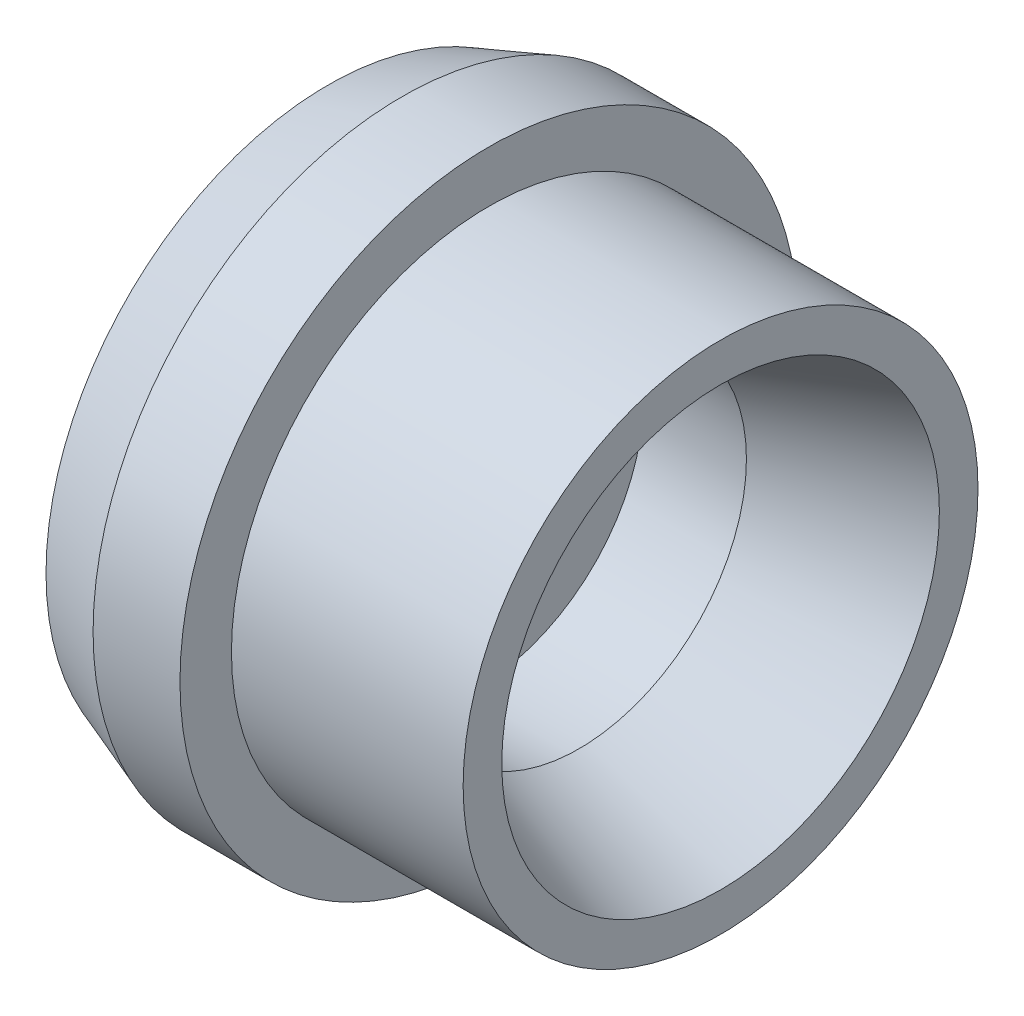
ISO-10303-21;
HEADER;
FILE_DESCRIPTION(('STEP AP214'),'2;1');
FILE_NAME('part.step','',(''),(''),'','','');
FILE_SCHEMA(('AUTOMOTIVE_DESIGN { 1 0 10303 214 1 1 1 1 }'));
ENDSEC;
DATA;
#1=APPLICATION_CONTEXT('core data for automotive mechanical design processes');
#2=APPLICATION_PROTOCOL_DEFINITION('international standard','automotive_design',2000,#1);
#3=PRODUCT_CONTEXT('',#1,'mechanical');
#4=PRODUCT('Part','Part','',(#3));
#5=PRODUCT_RELATED_PRODUCT_CATEGORY('part','',(#4));
#6=PRODUCT_DEFINITION_FORMATION('','',#4);
#7=PRODUCT_DEFINITION_CONTEXT('part definition',#1,'design');
#8=PRODUCT_DEFINITION('design','',#6,#7);
#9=PRODUCT_DEFINITION_SHAPE('','',#8);
#10=(LENGTH_UNIT() NAMED_UNIT(*) SI_UNIT(.MILLI.,.METRE.));
#11=(NAMED_UNIT(*) PLANE_ANGLE_UNIT() SI_UNIT($,.RADIAN.));
#12=(NAMED_UNIT(*) SI_UNIT($,.STERADIAN.) SOLID_ANGLE_UNIT());
#13=UNCERTAINTY_MEASURE_WITH_UNIT(LENGTH_MEASURE(1.E-05),#10,'distance_accuracy_value','');
#14=(GEOMETRIC_REPRESENTATION_CONTEXT(3) GLOBAL_UNCERTAINTY_ASSIGNED_CONTEXT((#13)) GLOBAL_UNIT_ASSIGNED_CONTEXT((#10,
#11,#12)) REPRESENTATION_CONTEXT('',''));
#15=CARTESIAN_POINT('',(0.,0.,0.));
#16=DIRECTION('',(0.,0.,1.));
#17=DIRECTION('',(1.,0.,0.));
#18=AXIS2_PLACEMENT_3D('',#15,#16,#17);
#19=CARTESIAN_POINT('',(0.,0.,0.));
#20=DIRECTION('',(-1.,0.,0.));
#21=DIRECTION('',(0.,0.,-1.));
#22=AXIS2_PLACEMENT_3D('',#19,#20,#21);
#23=PLANE('',#22);
#24=CARTESIAN_POINT('',(0.,0.,0.));
#25=DIRECTION('',(-1.,0.,0.));
#26=DIRECTION('',(0.,0.,1.));
#27=AXIS2_PLACEMENT_3D('',#24,#25,#26);
#28=CIRCLE('',#27,5.56442147285421);
#29=CARTESIAN_POINT('',(0.,0.,5.56442147285421));
#30=VERTEX_POINT('',#29);
#31=EDGE_CURVE('E10',#30,#30,#28,.T.);
#32=ORIENTED_EDGE('',*,*,#31,.T.);
#33=EDGE_LOOP('',(#32));
#34=FACE_BOUND('',#33,.T.);
#35=ADVANCED_FACE('F39',(#34),#23,.T.);
#36=CARTESIAN_POINT('',(1.4605,0.,0.));
#37=DIRECTION('',(1.,0.,0.));
#38=DIRECTION('',(0.,0.,1.));
#39=AXIS2_PLACEMENT_3D('',#36,#37,#38);
#40=CONICAL_SURFACE('',#39,6.096,0.349065850398867);
#41=ORIENTED_EDGE('',*,*,#31,.F.);
#42=EDGE_LOOP('',(#41));
#43=FACE_BOUND('',#42,.T.);
#44=CARTESIAN_POINT('',(1.4605,0.,0.));
#45=DIRECTION('',(-1.,0.,0.));
#46=DIRECTION('',(0.,0.,1.));
#47=AXIS2_PLACEMENT_3D('',#44,#45,#46);
#48=CIRCLE('',#47,6.096);
#49=CARTESIAN_POINT('',(1.4605,0.,6.096));
#50=VERTEX_POINT('',#49);
#51=EDGE_CURVE('E45',#50,#50,#48,.T.);
#52=ORIENTED_EDGE('',*,*,#51,.T.);
#53=EDGE_LOOP('',(#52));
#54=FACE_BOUND('',#53,.T.);
#55=ADVANCED_FACE('F83',(#43,#54),#40,.T.);
#56=CARTESIAN_POINT('',(2.921,0.,0.));
#57=DIRECTION('',(1.,0.,0.));
#58=DIRECTION('',(0.,0.,1.));
#59=AXIS2_PLACEMENT_3D('',#56,#57,#58);
#60=CYLINDRICAL_SURFACE('',#59,6.096);
#61=ORIENTED_EDGE('',*,*,#51,.F.);
#62=EDGE_LOOP('',(#61));
#63=FACE_BOUND('',#62,.T.);
#64=CARTESIAN_POINT('',(3.175,0.,0.));
#65=DIRECTION('',(-1.,0.,0.));
#66=DIRECTION('',(0.,0.,1.));
#67=AXIS2_PLACEMENT_3D('',#64,#65,#66);
#68=CIRCLE('',#67,6.096);
#69=CARTESIAN_POINT('',(3.175,0.,6.096));
#70=VERTEX_POINT('',#69);
#71=EDGE_CURVE('E49',#70,#70,#68,.T.);
#72=ORIENTED_EDGE('',*,*,#71,.T.);
#73=EDGE_LOOP('',(#72));
#74=FACE_BOUND('',#73,.T.);
#75=ADVANCED_FACE('F87',(#63,#74),#60,.T.);
#76=CARTESIAN_POINT('',(3.175,6.096,0.));
#77=DIRECTION('',(1.,0.,0.));
#78=DIRECTION('',(0.,0.,1.));
#79=AXIS2_PLACEMENT_3D('',#76,#77,#78);
#80=PLANE('',#79);
#81=ORIENTED_EDGE('',*,*,#71,.F.);
#82=EDGE_LOOP('',(#81));
#83=FACE_BOUND('',#82,.T.);
#84=CARTESIAN_POINT('',(3.175,0.,0.));
#85=DIRECTION('',(-1.,0.,0.));
#86=DIRECTION('',(0.,0.,1.));
#87=AXIS2_PLACEMENT_3D('',#84,#85,#86);
#88=CIRCLE('',#87,5.08);
#89=CARTESIAN_POINT('',(3.175,0.,5.08));
#90=VERTEX_POINT('',#89);
#91=EDGE_CURVE('E53',#90,#90,#88,.T.);
#92=ORIENTED_EDGE('',*,*,#91,.T.);
#93=EDGE_LOOP('',(#92));
#94=FACE_BOUND('',#93,.T.);
#95=ADVANCED_FACE('F92',(#83,#94),#80,.T.);
#96=CARTESIAN_POINT('',(2.921,0.,0.));
#97=DIRECTION('',(1.,0.,0.));
#98=DIRECTION('',(0.,0.,1.));
#99=AXIS2_PLACEMENT_3D('',#96,#97,#98);
#100=CYLINDRICAL_SURFACE('',#99,5.08);
#101=ORIENTED_EDGE('',*,*,#91,.F.);
#102=EDGE_LOOP('',(#101));
#103=FACE_BOUND('',#102,.T.);
#104=CARTESIAN_POINT('',(7.747,0.,0.));
#105=DIRECTION('',(-1.,0.,0.));
#106=DIRECTION('',(0.,0.,1.));
#107=AXIS2_PLACEMENT_3D('',#104,#105,#106);
#108=CIRCLE('',#107,5.08);
#109=CARTESIAN_POINT('',(7.747,0.,5.08));
#110=VERTEX_POINT('',#109);
#111=EDGE_CURVE('E58',#110,#110,#108,.T.);
#112=ORIENTED_EDGE('',*,*,#111,.T.);
#113=EDGE_LOOP('',(#112));
#114=FACE_BOUND('',#113,.T.);
#115=ADVANCED_FACE('F98',(#103,#114),#100,.T.);
#116=CARTESIAN_POINT('',(7.747,5.08,0.));
#117=DIRECTION('',(1.,0.,0.));
#118=DIRECTION('',(0.,0.,1.));
#119=AXIS2_PLACEMENT_3D('',#116,#117,#118);
#120=PLANE('',#119);
#121=ORIENTED_EDGE('',*,*,#111,.F.);
#122=EDGE_LOOP('',(#121));
#123=FACE_BOUND('',#122,.T.);
#124=CARTESIAN_POINT('',(7.747,0.,0.));
#125=DIRECTION('',(-1.,0.,0.));
#126=DIRECTION('',(0.,0.,1.));
#127=AXIS2_PLACEMENT_3D('',#124,#125,#126);
#128=CIRCLE('',#127,4.318);
#129=CARTESIAN_POINT('',(7.747,0.,4.318));
#130=VERTEX_POINT('',#129);
#131=EDGE_CURVE('E61',#130,#130,#128,.T.);
#132=ORIENTED_EDGE('',*,*,#131,.T.);
#133=EDGE_LOOP('',(#132));
#134=FACE_BOUND('',#133,.T.);
#135=ADVANCED_FACE('F102',(#123,#134),#120,.T.);
#136=CARTESIAN_POINT('',(4.95556294183411,0.,0.));
#137=DIRECTION('',(1.,0.,0.));
#138=DIRECTION('',(0.,0.,1.));
#139=AXIS2_PLACEMENT_3D('',#136,#137,#138);
#140=CONICAL_SURFACE('',#139,3.302,0.349065850398867);
#141=ORIENTED_EDGE('',*,*,#131,.F.);
#142=EDGE_LOOP('',(#141));
#143=FACE_BOUND('',#142,.T.);
#144=CARTESIAN_POINT('',(4.95556294183411,0.,0.));
#145=DIRECTION('',(-1.,0.,0.));
#146=DIRECTION('',(0.,0.,1.));
#147=AXIS2_PLACEMENT_3D('',#144,#145,#146);
#148=CIRCLE('',#147,3.302);
#149=CARTESIAN_POINT('',(4.95556294183411,0.,3.302));
#150=VERTEX_POINT('',#149);
#151=EDGE_CURVE('E64',#150,#150,#148,.T.);
#152=ORIENTED_EDGE('',*,*,#151,.T.);
#153=EDGE_LOOP('',(#152));
#154=FACE_BOUND('',#153,.T.);
#155=ADVANCED_FACE('F79',(#143,#154),#140,.F.);
#156=CARTESIAN_POINT('',(2.921,0.,0.));
#157=DIRECTION('',(1.,0.,0.));
#158=DIRECTION('',(0.,0.,1.));
#159=AXIS2_PLACEMENT_3D('',#156,#157,#158);
#160=CYLINDRICAL_SURFACE('',#159,3.302);
#161=ORIENTED_EDGE('',*,*,#151,.F.);
#162=EDGE_LOOP('',(#161));
#163=FACE_BOUND('',#162,.T.);
#164=CARTESIAN_POINT('',(2.921,0.,0.));
#165=DIRECTION('',(-1.,0.,0.));
#166=DIRECTION('',(0.,0.,1.));
#167=AXIS2_PLACEMENT_3D('',#164,#165,#166);
#168=CIRCLE('',#167,3.302);
#169=CARTESIAN_POINT('',(2.921,0.,3.302));
#170=VERTEX_POINT('',#169);
#171=EDGE_CURVE('E67',#170,#170,#168,.T.);
#172=ORIENTED_EDGE('',*,*,#171,.T.);
#173=EDGE_LOOP('',(#172));
#174=FACE_BOUND('',#173,.T.);
#175=ADVANCED_FACE('F71',(#163,#174),#160,.F.);
#176=CARTESIAN_POINT('',(2.921,3.302,0.));
#177=DIRECTION('',(1.,0.,0.));
#178=DIRECTION('',(0.,0.,1.));
#179=AXIS2_PLACEMENT_3D('',#176,#177,#178);
#180=PLANE('',#179);
#181=ORIENTED_EDGE('',*,*,#171,.F.);
#182=EDGE_LOOP('',(#181));
#183=FACE_BOUND('',#182,.T.);
#184=ADVANCED_FACE('F73',(#183),#180,.T.);
#185=CLOSED_SHELL('',(#35,#55,#75,#95,#115,#135,#155,#175,#184));
#186=MANIFOLD_SOLID_BREP('B2',#185);
#187=ADVANCED_BREP_SHAPE_REPRESENTATION('',(#18,#186),#14);
#188=SHAPE_DEFINITION_REPRESENTATION(#9,#187);
ENDSEC;
END-ISO-10303-21;
